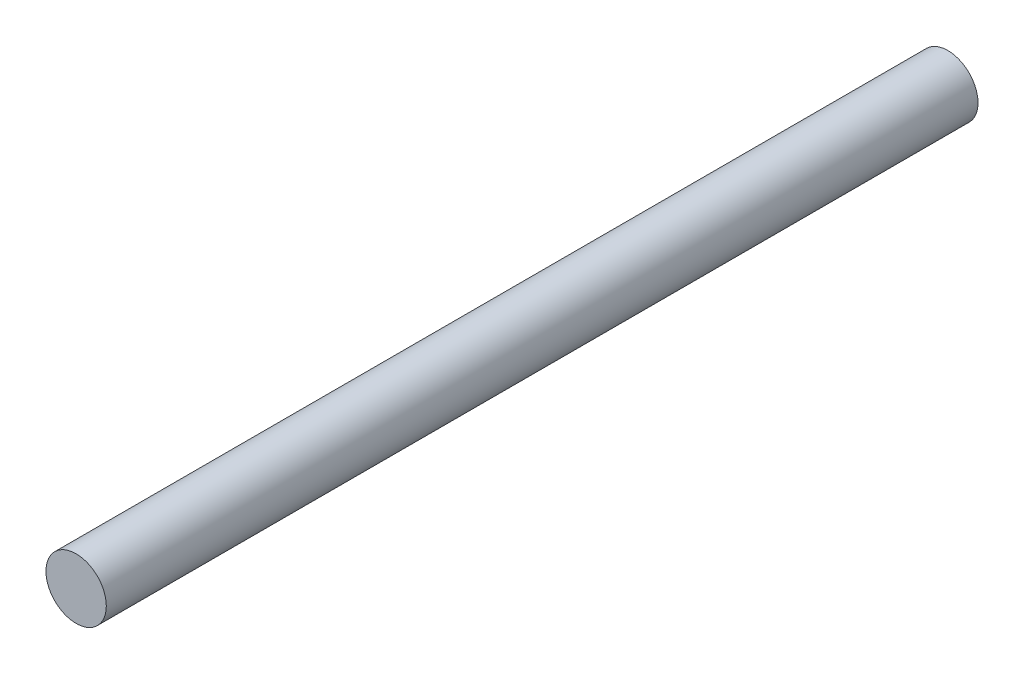
ISO-10303-21;
HEADER;
FILE_DESCRIPTION(('STEP AP214'),'2;1');
FILE_NAME('part.step','',(''),(''),'','','');
FILE_SCHEMA(('AUTOMOTIVE_DESIGN { 1 0 10303 214 1 1 1 1 }'));
ENDSEC;
DATA;
#1=APPLICATION_CONTEXT('core data for automotive mechanical design processes');
#2=APPLICATION_PROTOCOL_DEFINITION('international standard','automotive_design',2000,#1);
#3=PRODUCT_CONTEXT('',#1,'mechanical');
#4=PRODUCT('Part','Part','',(#3));
#5=PRODUCT_RELATED_PRODUCT_CATEGORY('part','',(#4));
#6=PRODUCT_DEFINITION_FORMATION('','',#4);
#7=PRODUCT_DEFINITION_CONTEXT('part definition',#1,'design');
#8=PRODUCT_DEFINITION('design','',#6,#7);
#9=PRODUCT_DEFINITION_SHAPE('','',#8);
#10=(LENGTH_UNIT() NAMED_UNIT(*) SI_UNIT(.MILLI.,.METRE.));
#11=(NAMED_UNIT(*) PLANE_ANGLE_UNIT() SI_UNIT($,.RADIAN.));
#12=(NAMED_UNIT(*) SI_UNIT($,.STERADIAN.) SOLID_ANGLE_UNIT());
#13=UNCERTAINTY_MEASURE_WITH_UNIT(LENGTH_MEASURE(1.E-05),#10,'distance_accuracy_value','');
#14=(GEOMETRIC_REPRESENTATION_CONTEXT(3) GLOBAL_UNCERTAINTY_ASSIGNED_CONTEXT((#13)) GLOBAL_UNIT_ASSIGNED_CONTEXT((#10,
#11,#12)) REPRESENTATION_CONTEXT('',''));
#15=CARTESIAN_POINT('',(0.,0.,0.));
#16=DIRECTION('',(0.,0.,1.));
#17=DIRECTION('',(1.,0.,0.));
#18=AXIS2_PLACEMENT_3D('',#15,#16,#17);
#19=CARTESIAN_POINT('',(0.,0.,33.02));
#20=DIRECTION('',(0.,0.,-1.));
#21=DIRECTION('',(-1.,0.,0.));
#22=AXIS2_PLACEMENT_3D('',#19,#20,#21);
#23=CYLINDRICAL_SURFACE('',#22,1.143);
#24=CARTESIAN_POINT('',(0.,0.,33.02));
#25=DIRECTION('',(0.,0.,1.));
#26=DIRECTION('',(1.,0.,0.));
#27=AXIS2_PLACEMENT_3D('',#24,#25,#26);
#28=CIRCLE('',#27,1.143);
#29=CARTESIAN_POINT('',(1.143,0.,33.02));
#30=VERTEX_POINT('',#29);
#31=EDGE_CURVE('E10',#30,#30,#28,.T.);
#32=ORIENTED_EDGE('',*,*,#31,.F.);
#33=EDGE_LOOP('',(#32));
#34=FACE_BOUND('',#33,.T.);
#35=CARTESIAN_POINT('',(0.,0.,0.));
#36=DIRECTION('',(0.,0.,1.));
#37=DIRECTION('',(1.,0.,0.));
#38=AXIS2_PLACEMENT_3D('',#35,#36,#37);
#39=CIRCLE('',#38,1.143);
#40=CARTESIAN_POINT('',(1.143,0.,0.));
#41=VERTEX_POINT('',#40);
#42=EDGE_CURVE('E44',#41,#41,#39,.T.);
#43=ORIENTED_EDGE('',*,*,#42,.T.);
#44=EDGE_LOOP('',(#43));
#45=FACE_BOUND('',#44,.T.);
#46=ADVANCED_FACE('F41',(#34,#45),#23,.T.);
#47=CARTESIAN_POINT('',(0.,0.,33.02));
#48=DIRECTION('',(0.,0.,1.));
#49=DIRECTION('',(1.,0.,0.));
#50=AXIS2_PLACEMENT_3D('',#47,#48,#49);
#51=PLANE('',#50);
#52=ORIENTED_EDGE('',*,*,#31,.T.);
#53=EDGE_LOOP('',(#52));
#54=FACE_BOUND('',#53,.T.);
#55=ADVANCED_FACE('F58',(#54),#51,.T.);
#56=CARTESIAN_POINT('',(0.,0.,0.));
#57=DIRECTION('',(0.,0.,1.));
#58=DIRECTION('',(1.,0.,0.));
#59=AXIS2_PLACEMENT_3D('',#56,#57,#58);
#60=PLANE('',#59);
#61=ORIENTED_EDGE('',*,*,#42,.F.);
#62=EDGE_LOOP('',(#61));
#63=FACE_BOUND('',#62,.T.);
#64=ADVANCED_FACE('F56',(#63),#60,.F.);
#65=CLOSED_SHELL('',(#46,#55,#64));
#66=MANIFOLD_SOLID_BREP('B2',#65);
#67=ADVANCED_BREP_SHAPE_REPRESENTATION('',(#18,#66),#14);
#68=SHAPE_DEFINITION_REPRESENTATION(#9,#67);
ENDSEC;
END-ISO-10303-21;
